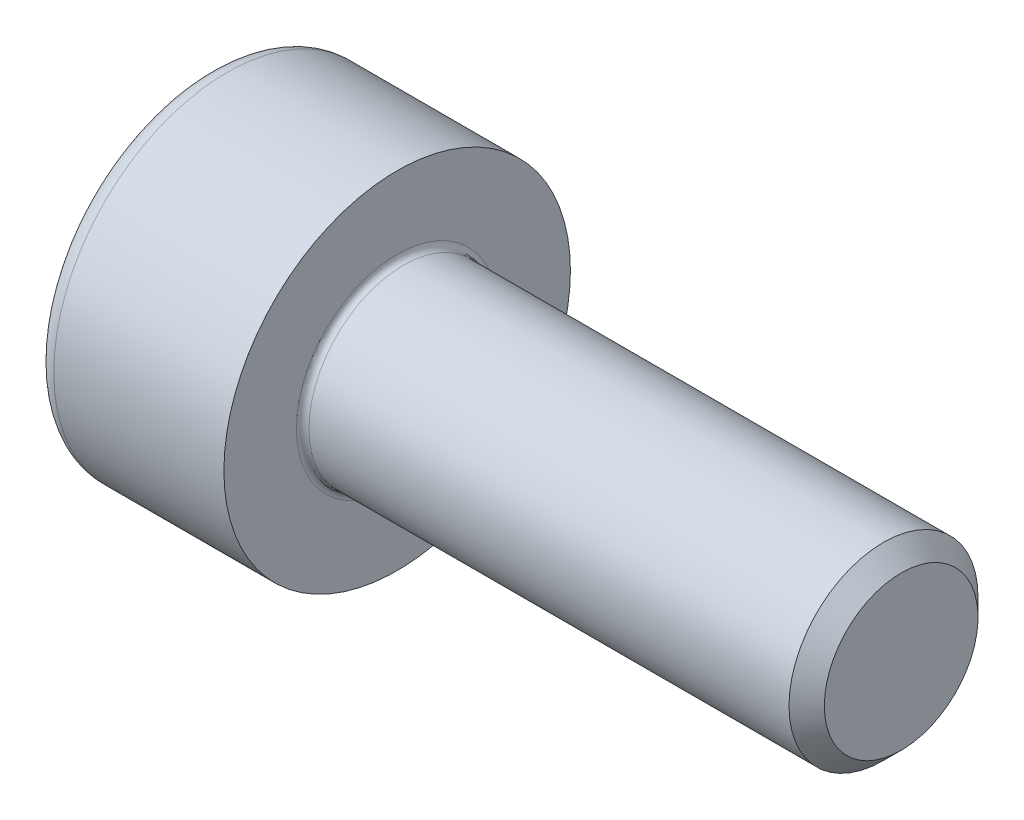
ISO-10303-21;
HEADER;
FILE_DESCRIPTION(('STEP AP214'),'2;1');
FILE_NAME('part.step','',(''),(''),'','','');
FILE_SCHEMA(('AUTOMOTIVE_DESIGN { 1 0 10303 214 1 1 1 1 }'));
ENDSEC;
DATA;
#1=APPLICATION_CONTEXT('core data for automotive mechanical design processes');
#2=APPLICATION_PROTOCOL_DEFINITION('international standard','automotive_design',2000,#1);
#3=PRODUCT_CONTEXT('',#1,'mechanical');
#4=PRODUCT('Part','Part','',(#3));
#5=PRODUCT_RELATED_PRODUCT_CATEGORY('part','',(#4));
#6=PRODUCT_DEFINITION_FORMATION('','',#4);
#7=PRODUCT_DEFINITION_CONTEXT('part definition',#1,'design');
#8=PRODUCT_DEFINITION('design','',#6,#7);
#9=PRODUCT_DEFINITION_SHAPE('','',#8);
#10=(LENGTH_UNIT() NAMED_UNIT(*) SI_UNIT(.MILLI.,.METRE.));
#11=(NAMED_UNIT(*) PLANE_ANGLE_UNIT() SI_UNIT($,.RADIAN.));
#12=(NAMED_UNIT(*) SI_UNIT($,.STERADIAN.) SOLID_ANGLE_UNIT());
#13=UNCERTAINTY_MEASURE_WITH_UNIT(LENGTH_MEASURE(1.E-05),#10,'distance_accuracy_value','');
#14=(GEOMETRIC_REPRESENTATION_CONTEXT(3) GLOBAL_UNCERTAINTY_ASSIGNED_CONTEXT((#13)) GLOBAL_UNIT_ASSIGNED_CONTEXT((#10,
#11,#12)) REPRESENTATION_CONTEXT('',''));
#15=CARTESIAN_POINT('',(0.,0.,0.));
#16=DIRECTION('',(0.,0.,1.));
#17=DIRECTION('',(1.,0.,0.));
#18=AXIS2_PLACEMENT_3D('',#15,#16,#17);
#19=CARTESIAN_POINT('',(0.,0.,0.));
#20=DIRECTION('',(-1.,0.,0.));
#21=DIRECTION('',(0.,0.,1.));
#22=AXIS2_PLACEMENT_3D('',#19,#20,#21);
#23=PLANE('',#22);
#24=DIRECTION('',(0.,-0.499999999999999,0.866025403784439));
#25=VECTOR('',#24,1.);
#26=CARTESIAN_POINT('',(0.,1.45492267835785,0.));
#27=LINE('',#26,#25);
#28=CARTESIAN_POINT('',(0.,1.45492267835785,0.));
#29=VERTEX_POINT('',#28);
#30=CARTESIAN_POINT('',(0.,0.727461339178922,1.26));
#31=VERTEX_POINT('',#30);
#32=EDGE_CURVE('E262',#29,#31,#27,.T.);
#33=ORIENTED_EDGE('',*,*,#32,.T.);
#34=DIRECTION('',(0.,1.,0.));
#35=VECTOR('',#34,1.);
#36=CARTESIAN_POINT('',(0.,-0.727461339178934,1.26));
#37=LINE('',#36,#35);
#38=CARTESIAN_POINT('',(0.,-0.727461339178934,1.26));
#39=VERTEX_POINT('',#38);
#40=EDGE_CURVE('E134',#39,#31,#37,.T.);
#41=ORIENTED_EDGE('',*,*,#40,.F.);
#42=DIRECTION('',(0.,-0.500000000000001,-0.866025403784438));
#43=VECTOR('',#42,1.);
#44=CARTESIAN_POINT('',(0.,-0.727461339178934,1.26));
#45=LINE('',#44,#43);
#46=CARTESIAN_POINT('',(0.,-1.45492267835786,0.));
#47=VERTEX_POINT('',#46);
#48=EDGE_CURVE('E265',#39,#47,#45,.T.);
#49=ORIENTED_EDGE('',*,*,#48,.T.);
#50=DIRECTION('',(0.,0.499999999999998,-0.86602540378444));
#51=VECTOR('',#50,1.);
#52=CARTESIAN_POINT('',(0.,-1.45492267835786,0.));
#53=LINE('',#52,#51);
#54=CARTESIAN_POINT('',(0.,-0.727461339178938,-1.26));
#55=VERTEX_POINT('',#54);
#56=EDGE_CURVE('E268',#47,#55,#53,.T.);
#57=ORIENTED_EDGE('',*,*,#56,.T.);
#58=DIRECTION('',(0.,-1.,0.));
#59=VECTOR('',#58,1.);
#60=CARTESIAN_POINT('',(0.,0.727461339178918,-1.26));
#61=LINE('',#60,#59);
#62=CARTESIAN_POINT('',(0.,0.727461339178918,-1.26));
#63=VERTEX_POINT('',#62);
#64=EDGE_CURVE('E271',#63,#55,#61,.T.);
#65=ORIENTED_EDGE('',*,*,#64,.F.);
#66=DIRECTION('',(0.,-0.500000000000001,-0.866025403784438));
#67=VECTOR('',#66,1.);
#68=CARTESIAN_POINT('',(0.,1.45492267835785,0.));
#69=LINE('',#68,#67);
#70=EDGE_CURVE('E129',#29,#63,#69,.T.);
#71=ORIENTED_EDGE('',*,*,#70,.F.);
#72=EDGE_LOOP('',(#33,#41,#49,#57,#65,#71));
#73=FACE_BOUND('',#72,.T.);
#74=CARTESIAN_POINT('',(0.,0.,0.));
#75=DIRECTION('',(-1.,0.,0.));
#76=DIRECTION('',(0.,0.,1.));
#77=AXIS2_PLACEMENT_3D('',#74,#75,#76);
#78=CIRCLE('',#77,2.45);
#79=CARTESIAN_POINT('',(0.,0.,2.45));
#80=VERTEX_POINT('',#79);
#81=EDGE_CURVE('E46',#80,#80,#78,.T.);
#82=ORIENTED_EDGE('',*,*,#81,.T.);
#83=EDGE_LOOP('',(#82));
#84=FACE_BOUND('',#83,.T.);
#85=ADVANCED_FACE('F38',(#73,#84),#23,.T.);
#86=CARTESIAN_POINT('',(-31.75,0.,0.));
#87=DIRECTION('',(-1.,0.,0.));
#88=DIRECTION('',(0.,0.,1.));
#89=AXIS2_PLACEMENT_3D('',#86,#87,#88);
#90=CYLINDRICAL_SURFACE('',#89,2.75);
#91=CARTESIAN_POINT('',(0.300000000000002,0.,0.));
#92=DIRECTION('',(-1.,0.,0.));
#93=DIRECTION('',(0.,0.,1.));
#94=AXIS2_PLACEMENT_3D('',#91,#92,#93);
#95=CIRCLE('',#94,2.75);
#96=CARTESIAN_POINT('',(0.300000000000002,0.,2.75));
#97=VERTEX_POINT('',#96);
#98=EDGE_CURVE('E11',#97,#97,#95,.F.);
#99=ORIENTED_EDGE('',*,*,#98,.T.);
#100=EDGE_LOOP('',(#99));
#101=FACE_BOUND('',#100,.T.);
#102=CARTESIAN_POINT('',(3.,0.,0.));
#103=DIRECTION('',(-1.,0.,0.));
#104=DIRECTION('',(0.,0.,1.));
#105=AXIS2_PLACEMENT_3D('',#102,#103,#104);
#106=CIRCLE('',#105,2.75);
#107=CARTESIAN_POINT('',(3.,0.,2.75));
#108=VERTEX_POINT('',#107);
#109=EDGE_CURVE('E152',#108,#108,#106,.T.);
#110=ORIENTED_EDGE('',*,*,#109,.T.);
#111=EDGE_LOOP('',(#110));
#112=FACE_BOUND('',#111,.T.);
#113=ADVANCED_FACE('F176',(#101,#112),#90,.T.);
#114=CARTESIAN_POINT('',(3.,2.75,0.));
#115=DIRECTION('',(1.,0.,0.));
#116=DIRECTION('',(0.,0.,-1.));
#117=AXIS2_PLACEMENT_3D('',#114,#115,#116);
#118=PLANE('',#117);
#119=CARTESIAN_POINT('',(3.,0.,0.));
#120=DIRECTION('',(1.,0.,0.));
#121=DIRECTION('',(0.,0.,-1.));
#122=AXIS2_PLACEMENT_3D('',#119,#120,#121);
#123=CIRCLE('',#122,1.59999999999996);
#124=CARTESIAN_POINT('',(3.,0.,-1.59999999999996));
#125=VERTEX_POINT('',#124);
#126=EDGE_CURVE('E155',#125,#125,#123,.F.);
#127=ORIENTED_EDGE('',*,*,#126,.T.);
#128=EDGE_LOOP('',(#127));
#129=FACE_BOUND('',#128,.T.);
#130=ORIENTED_EDGE('',*,*,#109,.F.);
#131=EDGE_LOOP('',(#130));
#132=FACE_BOUND('',#131,.T.);
#133=ADVANCED_FACE('F182',(#129,#132),#118,.T.);
#134=CARTESIAN_POINT('',(-31.75,0.,0.));
#135=DIRECTION('',(-1.,0.,0.));
#136=DIRECTION('',(0.,0.,1.));
#137=AXIS2_PLACEMENT_3D('',#134,#135,#136);
#138=CYLINDRICAL_SURFACE('',#137,1.49999999999996);
#139=CARTESIAN_POINT('',(3.1,0.,0.));
#140=DIRECTION('',(1.,0.,0.));
#141=DIRECTION('',(0.,0.,-1.));
#142=AXIS2_PLACEMENT_3D('',#139,#140,#141);
#143=CIRCLE('',#142,1.49999999999996);
#144=CARTESIAN_POINT('',(3.1,0.,-1.49999999999996));
#145=VERTEX_POINT('',#144);
#146=EDGE_CURVE('E158',#145,#145,#143,.T.);
#147=ORIENTED_EDGE('',*,*,#146,.T.);
#148=EDGE_LOOP('',(#147));
#149=FACE_BOUND('',#148,.T.);
#150=CARTESIAN_POINT('',(10.7194999999999,0.,0.));
#151=DIRECTION('',(-1.,0.,0.));
#152=DIRECTION('',(0.,0.,1.));
#153=AXIS2_PLACEMENT_3D('',#150,#151,#152);
#154=CIRCLE('',#153,1.49999999999993);
#155=CARTESIAN_POINT('',(10.7194999999999,0.,1.49999999999993));
#156=VERTEX_POINT('',#155);
#157=EDGE_CURVE('E149',#156,#156,#154,.T.);
#158=ORIENTED_EDGE('',*,*,#157,.T.);
#159=EDGE_LOOP('',(#158));
#160=FACE_BOUND('',#159,.T.);
#161=ADVANCED_FACE('F188',(#149,#160),#138,.T.);
#162=CARTESIAN_POINT('',(11.,0.,0.));
#163=DIRECTION('',(-1.,0.,0.));
#164=DIRECTION('',(0.,0.,1.));
#165=AXIS2_PLACEMENT_3D('',#162,#163,#164);
#166=CONICAL_SURFACE('',#165,1.2195,0.785398163397206);
#167=ORIENTED_EDGE('',*,*,#157,.F.);
#168=EDGE_LOOP('',(#167));
#169=FACE_BOUND('',#168,.T.);
#170=CARTESIAN_POINT('',(11.,0.,0.));
#171=DIRECTION('',(-1.,0.,0.));
#172=DIRECTION('',(0.,0.,1.));
#173=AXIS2_PLACEMENT_3D('',#170,#171,#172);
#174=CIRCLE('',#173,1.2195);
#175=CARTESIAN_POINT('',(11.,0.,1.2195));
#176=VERTEX_POINT('',#175);
#177=EDGE_CURVE('E145',#176,#176,#174,.T.);
#178=ORIENTED_EDGE('',*,*,#177,.T.);
#179=EDGE_LOOP('',(#178));
#180=FACE_BOUND('',#179,.T.);
#181=ADVANCED_FACE('F192',(#169,#180),#166,.T.);
#182=CARTESIAN_POINT('',(11.,1.2195,0.));
#183=DIRECTION('',(1.,0.,0.));
#184=DIRECTION('',(0.,0.,-1.));
#185=AXIS2_PLACEMENT_3D('',#182,#183,#184);
#186=PLANE('',#185);
#187=ORIENTED_EDGE('',*,*,#177,.F.);
#188=EDGE_LOOP('',(#187));
#189=FACE_BOUND('',#188,.T.);
#190=ADVANCED_FACE('F172',(#189),#186,.T.);
#191=CARTESIAN_POINT('',(3.1,0.,0.));
#192=DIRECTION('',(1.,0.,0.));
#193=DIRECTION('',(0.,0.,-1.));
#194=AXIS2_PLACEMENT_3D('',#191,#192,#193);
#195=TOROIDAL_SURFACE('',#194,1.59999999999996,0.1);
#196=ORIENTED_EDGE('',*,*,#146,.F.);
#197=EDGE_LOOP('',(#196));
#198=FACE_BOUND('',#197,.T.);
#199=ORIENTED_EDGE('',*,*,#126,.F.);
#200=EDGE_LOOP('',(#199));
#201=FACE_BOUND('',#200,.T.);
#202=ADVANCED_FACE('F165',(#198,#201),#195,.F.);
#203=CARTESIAN_POINT('',(0.300000000000002,0.,0.));
#204=DIRECTION('',(-1.,0.,0.));
#205=DIRECTION('',(0.,0.,1.));
#206=AXIS2_PLACEMENT_3D('',#203,#204,#205);
#207=TOROIDAL_SURFACE('',#206,2.45,0.3);
#208=ORIENTED_EDGE('',*,*,#98,.F.);
#209=EDGE_LOOP('',(#208));
#210=FACE_BOUND('',#209,.T.);
#211=ORIENTED_EDGE('',*,*,#81,.F.);
#212=EDGE_LOOP('',(#211));
#213=FACE_BOUND('',#212,.T.);
#214=ADVANCED_FACE('F40',(#210,#213),#207,.T.);
#215=CARTESIAN_POINT('',(1.3,1.45492267835785,0.));
#216=DIRECTION('',(0.,-0.866025403784439,-0.499999999999999));
#217=DIRECTION('',(0.,0.499999999999999,-0.866025403784439));
#218=AXIS2_PLACEMENT_3D('',#215,#216,#217);
#219=PLANE('',#218);
#220=ORIENTED_EDGE('',*,*,#32,.F.);
#221=DIRECTION('',(-1.,0.,0.));
#222=VECTOR('',#221,1.);
#223=CARTESIAN_POINT('',(1.3,1.45492267835785,0.));
#224=LINE('',#223,#222);
#225=CARTESIAN_POINT('',(1.3,1.45492267835785,0.));
#226=VERTEX_POINT('',#225);
#227=EDGE_CURVE('E252',#226,#29,#224,.T.);
#228=ORIENTED_EDGE('',*,*,#227,.F.);
#229=DIRECTION('',(0.,-0.499999999999999,0.866025403784439));
#230=VECTOR('',#229,1.);
#231=CARTESIAN_POINT('',(1.3,1.45492267835785,0.));
#232=LINE('',#231,#230);
#233=CARTESIAN_POINT('',(1.3,1.09119200876839,0.629999999999996));
#234=VERTEX_POINT('',#233);
#235=EDGE_CURVE('E121',#226,#234,#232,.T.);
#236=ORIENTED_EDGE('',*,*,#235,.T.);
#237=CARTESIAN_POINT('',(1.3,0.727461339178922,1.26));
#238=VERTEX_POINT('',#237);
#239=EDGE_CURVE('E112',#234,#238,#232,.T.);
#240=ORIENTED_EDGE('',*,*,#239,.T.);
#241=DIRECTION('',(-1.,0.,0.));
#242=VECTOR('',#241,1.);
#243=CARTESIAN_POINT('',(1.3,0.727461339178922,1.26));
#244=LINE('',#243,#242);
#245=EDGE_CURVE('E126',#238,#31,#244,.T.);
#246=ORIENTED_EDGE('',*,*,#245,.T.);
#247=EDGE_LOOP('',(#220,#228,#236,#240,#246));
#248=FACE_BOUND('',#247,.T.);
#249=ADVANCED_FACE('F125',(#248),#219,.T.);
#250=CARTESIAN_POINT('',(1.3,-0.727461339178934,1.26));
#251=DIRECTION('',(0.,0.,1.));
#252=DIRECTION('',(0.,-1.,0.));
#253=AXIS2_PLACEMENT_3D('',#250,#251,#252);
#254=PLANE('',#253);
#255=ORIENTED_EDGE('',*,*,#40,.T.);
#256=ORIENTED_EDGE('',*,*,#245,.F.);
#257=DIRECTION('',(0.,1.,0.));
#258=VECTOR('',#257,1.);
#259=CARTESIAN_POINT('',(1.3,-0.727461339178934,1.26));
#260=LINE('',#259,#258);
#261=CARTESIAN_POINT('',(1.3,0.,1.26));
#262=VERTEX_POINT('',#261);
#263=EDGE_CURVE('E109',#262,#238,#260,.T.);
#264=ORIENTED_EDGE('',*,*,#263,.F.);
#265=CARTESIAN_POINT('',(1.3,-0.727461339178934,1.26));
#266=VERTEX_POINT('',#265);
#267=EDGE_CURVE('E120',#266,#262,#260,.T.);
#268=ORIENTED_EDGE('',*,*,#267,.F.);
#269=DIRECTION('',(-1.,0.,0.));
#270=VECTOR('',#269,1.);
#271=CARTESIAN_POINT('',(1.3,-0.727461339178934,1.26));
#272=LINE('',#271,#270);
#273=EDGE_CURVE('E136',#266,#39,#272,.T.);
#274=ORIENTED_EDGE('',*,*,#273,.T.);
#275=EDGE_LOOP('',(#255,#256,#264,#268,#274));
#276=FACE_BOUND('',#275,.T.);
#277=ADVANCED_FACE('F131',(#276),#254,.F.);
#278=CARTESIAN_POINT('',(1.3,-0.727461339178934,1.26));
#279=DIRECTION('',(0.,0.866025403784438,-0.500000000000001));
#280=DIRECTION('',(0.,0.500000000000001,0.866025403784438));
#281=AXIS2_PLACEMENT_3D('',#278,#279,#280);
#282=PLANE('',#281);
#283=ORIENTED_EDGE('',*,*,#48,.F.);
#284=ORIENTED_EDGE('',*,*,#273,.F.);
#285=DIRECTION('',(0.,-0.500000000000001,-0.866025403784438));
#286=VECTOR('',#285,1.);
#287=CARTESIAN_POINT('',(1.3,-0.727461339178934,1.26));
#288=LINE('',#287,#286);
#289=CARTESIAN_POINT('',(1.3,-1.0911920087684,0.630000000000005));
#290=VERTEX_POINT('',#289);
#291=EDGE_CURVE('E291',#266,#290,#288,.T.);
#292=ORIENTED_EDGE('',*,*,#291,.T.);
#293=CARTESIAN_POINT('',(1.3,-1.45492267835786,0.));
#294=VERTEX_POINT('',#293);
#295=EDGE_CURVE('E280',#290,#294,#288,.T.);
#296=ORIENTED_EDGE('',*,*,#295,.T.);
#297=DIRECTION('',(-1.,0.,0.));
#298=VECTOR('',#297,1.);
#299=CARTESIAN_POINT('',(1.3,-1.45492267835786,0.));
#300=LINE('',#299,#298);
#301=EDGE_CURVE('E141',#294,#47,#300,.T.);
#302=ORIENTED_EDGE('',*,*,#301,.T.);
#303=EDGE_LOOP('',(#283,#284,#292,#296,#302));
#304=FACE_BOUND('',#303,.T.);
#305=ADVANCED_FACE('F206',(#304),#282,.T.);
#306=CARTESIAN_POINT('',(1.3,-1.45492267835786,0.));
#307=DIRECTION('',(0.,0.86602540378444,0.499999999999998));
#308=DIRECTION('',(0.,-0.499999999999998,0.86602540378444));
#309=AXIS2_PLACEMENT_3D('',#306,#307,#308);
#310=PLANE('',#309);
#311=ORIENTED_EDGE('',*,*,#56,.F.);
#312=ORIENTED_EDGE('',*,*,#301,.F.);
#313=DIRECTION('',(0.,0.499999999999998,-0.86602540378444));
#314=VECTOR('',#313,1.);
#315=CARTESIAN_POINT('',(1.3,-1.45492267835786,0.));
#316=LINE('',#315,#314);
#317=CARTESIAN_POINT('',(1.3,-1.0911920087684,-0.63));
#318=VERTEX_POINT('',#317);
#319=EDGE_CURVE('E258',#294,#318,#316,.T.);
#320=ORIENTED_EDGE('',*,*,#319,.T.);
#321=CARTESIAN_POINT('',(1.3,-0.727461339178938,-1.26));
#322=VERTEX_POINT('',#321);
#323=EDGE_CURVE('E290',#318,#322,#316,.T.);
#324=ORIENTED_EDGE('',*,*,#323,.T.);
#325=DIRECTION('',(-1.,0.,0.));
#326=VECTOR('',#325,1.);
#327=CARTESIAN_POINT('',(1.3,-0.727461339178938,-1.26));
#328=LINE('',#327,#326);
#329=EDGE_CURVE('E251',#322,#55,#328,.T.);
#330=ORIENTED_EDGE('',*,*,#329,.T.);
#331=EDGE_LOOP('',(#311,#312,#320,#324,#330));
#332=FACE_BOUND('',#331,.T.);
#333=ADVANCED_FACE('F209',(#332),#310,.T.);
#334=CARTESIAN_POINT('',(1.3,0.727461339178918,-1.26));
#335=DIRECTION('',(0.,0.,-1.));
#336=DIRECTION('',(0.,1.,0.));
#337=AXIS2_PLACEMENT_3D('',#334,#335,#336);
#338=PLANE('',#337);
#339=ORIENTED_EDGE('',*,*,#64,.T.);
#340=ORIENTED_EDGE('',*,*,#329,.F.);
#341=DIRECTION('',(0.,-1.,0.));
#342=VECTOR('',#341,1.);
#343=CARTESIAN_POINT('',(1.3,0.727461339178918,-1.26));
#344=LINE('',#343,#342);
#345=CARTESIAN_POINT('',(1.3,0.,-1.26));
#346=VERTEX_POINT('',#345);
#347=EDGE_CURVE('E255',#346,#322,#344,.T.);
#348=ORIENTED_EDGE('',*,*,#347,.F.);
#349=CARTESIAN_POINT('',(1.3,0.727461339178918,-1.26));
#350=VERTEX_POINT('',#349);
#351=EDGE_CURVE('E53',#350,#346,#344,.T.);
#352=ORIENTED_EDGE('',*,*,#351,.F.);
#353=DIRECTION('',(-1.,0.,0.));
#354=VECTOR('',#353,1.);
#355=CARTESIAN_POINT('',(1.3,0.727461339178918,-1.26));
#356=LINE('',#355,#354);
#357=EDGE_CURVE('E248',#350,#63,#356,.T.);
#358=ORIENTED_EDGE('',*,*,#357,.T.);
#359=EDGE_LOOP('',(#339,#340,#348,#352,#358));
#360=FACE_BOUND('',#359,.T.);
#361=ADVANCED_FACE('F213',(#360),#338,.F.);
#362=CARTESIAN_POINT('',(1.3,1.45492267835785,0.));
#363=DIRECTION('',(0.,0.866025403784438,-0.500000000000001));
#364=DIRECTION('',(0.,0.500000000000001,0.866025403784438));
#365=AXIS2_PLACEMENT_3D('',#362,#363,#364);
#366=PLANE('',#365);
#367=ORIENTED_EDGE('',*,*,#70,.T.);
#368=ORIENTED_EDGE('',*,*,#357,.F.);
#369=DIRECTION('',(0.,-0.500000000000001,-0.866025403784438));
#370=VECTOR('',#369,1.);
#371=CARTESIAN_POINT('',(1.3,1.45492267835785,0.));
#372=LINE('',#371,#370);
#373=CARTESIAN_POINT('',(1.3,1.09119200876838,-0.629999999999997));
#374=VERTEX_POINT('',#373);
#375=EDGE_CURVE('E238',#374,#350,#372,.T.);
#376=ORIENTED_EDGE('',*,*,#375,.F.);
#377=EDGE_CURVE('E244',#226,#374,#372,.T.);
#378=ORIENTED_EDGE('',*,*,#377,.F.);
#379=ORIENTED_EDGE('',*,*,#227,.T.);
#380=EDGE_LOOP('',(#367,#368,#376,#378,#379));
#381=FACE_BOUND('',#380,.T.);
#382=ADVANCED_FACE('F217',(#381),#366,.F.);
#383=CARTESIAN_POINT('',(1.3,2.18238401753677,-1.26));
#384=DIRECTION('',(1.,0.,0.));
#385=DIRECTION('',(0.,0.,-1.));
#386=AXIS2_PLACEMENT_3D('',#383,#384,#385);
#387=PLANE('',#386);
#388=ORIENTED_EDGE('',*,*,#347,.T.);
#389=ORIENTED_EDGE('',*,*,#323,.F.);
#390=CARTESIAN_POINT('',(1.3,0.,0.));
#391=DIRECTION('',(-1.,0.,0.));
#392=DIRECTION('',(0.,0.,1.));
#393=AXIS2_PLACEMENT_3D('',#390,#391,#392);
#394=CIRCLE('',#393,1.26);
#395=EDGE_CURVE('E286',#346,#318,#394,.T.);
#396=ORIENTED_EDGE('',*,*,#395,.F.);
#397=EDGE_LOOP('',(#388,#389,#396));
#398=FACE_BOUND('',#397,.T.);
#399=ADVANCED_FACE('F221',(#398),#387,.F.);
#400=ORIENTED_EDGE('',*,*,#319,.F.);
#401=ORIENTED_EDGE('',*,*,#295,.F.);
#402=EDGE_CURVE('E139',#318,#290,#394,.T.);
#403=ORIENTED_EDGE('',*,*,#402,.F.);
#404=EDGE_LOOP('',(#400,#401,#403));
#405=FACE_BOUND('',#404,.T.);
#406=ADVANCED_FACE('F224',(#405),#387,.F.);
#407=ORIENTED_EDGE('',*,*,#291,.F.);
#408=ORIENTED_EDGE('',*,*,#267,.T.);
#409=EDGE_CURVE('E135',#290,#262,#394,.T.);
#410=ORIENTED_EDGE('',*,*,#409,.F.);
#411=EDGE_LOOP('',(#407,#408,#410));
#412=FACE_BOUND('',#411,.T.);
#413=ADVANCED_FACE('F229',(#412),#387,.F.);
#414=ORIENTED_EDGE('',*,*,#263,.T.);
#415=ORIENTED_EDGE('',*,*,#239,.F.);
#416=EDGE_CURVE('E115',#262,#234,#394,.T.);
#417=ORIENTED_EDGE('',*,*,#416,.F.);
#418=EDGE_LOOP('',(#414,#415,#417));
#419=FACE_BOUND('',#418,.T.);
#420=ADVANCED_FACE('F111',(#419),#387,.F.);
#421=ORIENTED_EDGE('',*,*,#235,.F.);
#422=ORIENTED_EDGE('',*,*,#377,.T.);
#423=EDGE_CURVE('E146',#234,#374,#394,.T.);
#424=ORIENTED_EDGE('',*,*,#423,.F.);
#425=EDGE_LOOP('',(#421,#422,#424));
#426=FACE_BOUND('',#425,.T.);
#427=ADVANCED_FACE('F232',(#426),#387,.F.);
#428=ORIENTED_EDGE('',*,*,#375,.T.);
#429=ORIENTED_EDGE('',*,*,#351,.T.);
#430=EDGE_CURVE('E241',#374,#346,#394,.T.);
#431=ORIENTED_EDGE('',*,*,#430,.F.);
#432=EDGE_LOOP('',(#428,#429,#431));
#433=FACE_BOUND('',#432,.T.);
#434=ADVANCED_FACE('F202',(#433),#387,.F.);
#435=CARTESIAN_POINT('',(1.3,0.,0.));
#436=DIRECTION('',(-1.,0.,0.));
#437=DIRECTION('',(0.,0.,1.));
#438=AXIS2_PLACEMENT_3D('',#435,#436,#437);
#439=CONICAL_SURFACE('',#438,1.26,1.04719755119659);
#440=CARTESIAN_POINT('',(2.02746133917894,0.,0.));
#441=VERTEX_POINT('',#440);
#442=VERTEX_LOOP('',#441);
#443=FACE_BOUND('',#442,.T.);
#444=ORIENTED_EDGE('',*,*,#416,.T.);
#445=ORIENTED_EDGE('',*,*,#423,.T.);
#446=ORIENTED_EDGE('',*,*,#430,.T.);
#447=ORIENTED_EDGE('',*,*,#395,.T.);
#448=ORIENTED_EDGE('',*,*,#402,.T.);
#449=ORIENTED_EDGE('',*,*,#409,.T.);
#450=EDGE_LOOP('',(#444,#445,#446,#447,#448,#449));
#451=FACE_BOUND('',#450,.T.);
#452=ADVANCED_FACE('F200',(#443,#451),#439,.F.);
#453=CLOSED_SHELL('',(#85,#113,#133,#161,#181,#190,#202,#214,#249,#277,#305,#333,#361,#382,#399,
#406,#413,#420,#427,#434,#452));
#454=MANIFOLD_SOLID_BREP('B2',#453);
#455=ADVANCED_BREP_SHAPE_REPRESENTATION('',(#18,#454),#14);
#456=SHAPE_DEFINITION_REPRESENTATION(#9,#455);
ENDSEC;
END-ISO-10303-21;
